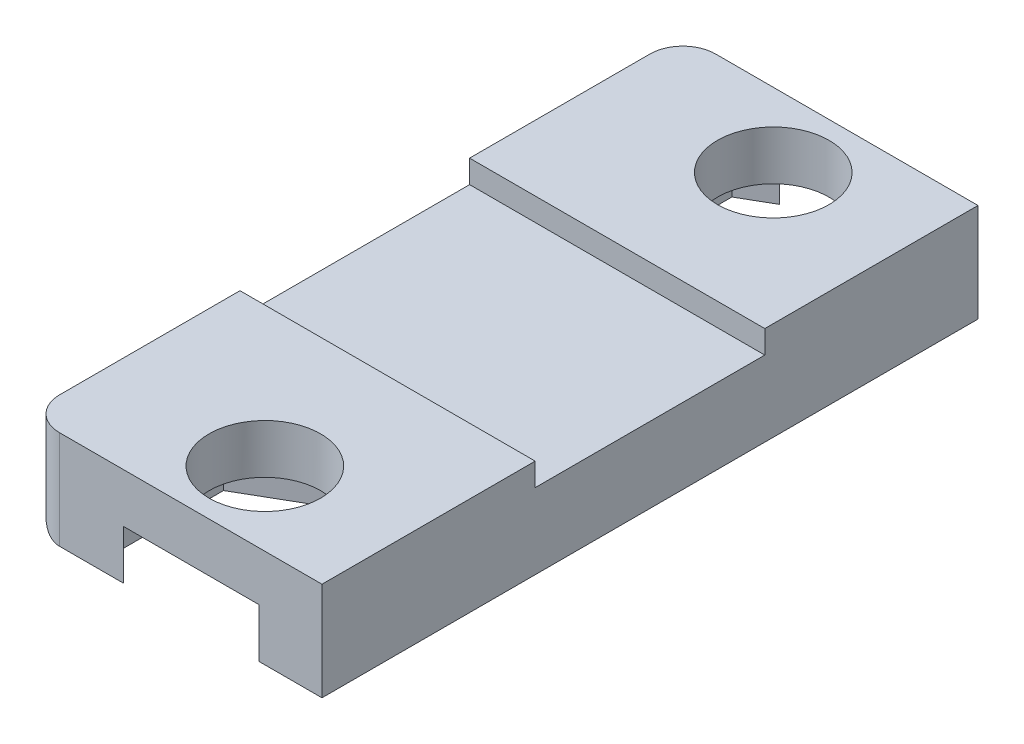
ISO-10303-21;
HEADER;
FILE_DESCRIPTION(('STEP AP214'),'2;1');
FILE_NAME('part.step','',(''),(''),'','','');
FILE_SCHEMA(('AUTOMOTIVE_DESIGN { 1 0 10303 214 1 1 1 1 }'));
ENDSEC;
DATA;
#1=APPLICATION_CONTEXT('core data for automotive mechanical design processes');
#2=APPLICATION_PROTOCOL_DEFINITION('international standard','automotive_design',2000,#1);
#3=PRODUCT_CONTEXT('',#1,'mechanical');
#4=PRODUCT('Part','Part','',(#3));
#5=PRODUCT_RELATED_PRODUCT_CATEGORY('part','',(#4));
#6=PRODUCT_DEFINITION_FORMATION('','',#4);
#7=PRODUCT_DEFINITION_CONTEXT('part definition',#1,'design');
#8=PRODUCT_DEFINITION('design','',#6,#7);
#9=PRODUCT_DEFINITION_SHAPE('','',#8);
#10=(LENGTH_UNIT() NAMED_UNIT(*) SI_UNIT(.MILLI.,.METRE.));
#11=(NAMED_UNIT(*) PLANE_ANGLE_UNIT() SI_UNIT($,.RADIAN.));
#12=(NAMED_UNIT(*) SI_UNIT($,.STERADIAN.) SOLID_ANGLE_UNIT());
#13=UNCERTAINTY_MEASURE_WITH_UNIT(LENGTH_MEASURE(1.E-05),#10,'distance_accuracy_value','');
#14=(GEOMETRIC_REPRESENTATION_CONTEXT(3) GLOBAL_UNCERTAINTY_ASSIGNED_CONTEXT((#13)) GLOBAL_UNIT_ASSIGNED_CONTEXT((#10,
#11,#12)) REPRESENTATION_CONTEXT('',''));
#15=CARTESIAN_POINT('',(0.,0.,0.));
#16=DIRECTION('',(0.,0.,1.));
#17=DIRECTION('',(1.,0.,0.));
#18=AXIS2_PLACEMENT_3D('',#15,#16,#17);
#19=CARTESIAN_POINT('',(169.955426616135,-1.,15.5));
#20=DIRECTION('',(0.,0.,1.));
#21=DIRECTION('',(1.,0.,0.));
#22=AXIS2_PLACEMENT_3D('',#19,#20,#21);
#23=PLANE('',#22);
#24=DIRECTION('',(1.,0.,0.));
#25=VECTOR('',#24,1.);
#26=CARTESIAN_POINT('',(169.954426616135,-0.7,15.5));
#27=LINE('',#26,#25);
#28=CARTESIAN_POINT('',(160.954426616135,-0.7,15.5));
#29=VERTEX_POINT('',#28);
#30=CARTESIAN_POINT('',(169.954426616135,-0.7,15.5));
#31=VERTEX_POINT('',#30);
#32=EDGE_CURVE('E56',#29,#31,#27,.T.);
#33=ORIENTED_EDGE('',*,*,#32,.F.);
#34=DIRECTION('',(0.,1.,0.));
#35=VECTOR('',#34,1.);
#36=CARTESIAN_POINT('',(160.954426616135,-1.,15.5));
#37=LINE('',#36,#35);
#38=CARTESIAN_POINT('',(160.954426616135,0.,15.5));
#39=VERTEX_POINT('',#38);
#40=EDGE_CURVE('E206',#29,#39,#37,.T.);
#41=ORIENTED_EDGE('',*,*,#40,.T.);
#42=DIRECTION('',(-1.,0.,0.));
#43=VECTOR('',#42,1.);
#44=CARTESIAN_POINT('',(169.955426616135,0.,15.5));
#45=LINE('',#44,#43);
#46=CARTESIAN_POINT('',(169.954426616135,0.,15.5));
#47=VERTEX_POINT('',#46);
#48=EDGE_CURVE('E205',#47,#39,#45,.T.);
#49=ORIENTED_EDGE('',*,*,#48,.F.);
#50=DIRECTION('',(0.,1.,0.));
#51=VECTOR('',#50,1.);
#52=CARTESIAN_POINT('',(169.954426616135,-1.,15.5));
#53=LINE('',#52,#51);
#54=EDGE_CURVE('E52',#31,#47,#53,.T.);
#55=ORIENTED_EDGE('',*,*,#54,.F.);
#56=EDGE_LOOP('',(#33,#41,#49,#55));
#57=FACE_BOUND('',#56,.T.);
#58=ADVANCED_FACE('F35',(#57),#23,.F.);
#59=CARTESIAN_POINT('',(169.955426616135,-1.,8.5));
#60=DIRECTION('',(0.,0.,-1.));
#61=DIRECTION('',(-1.,0.,0.));
#62=AXIS2_PLACEMENT_3D('',#59,#60,#61);
#63=PLANE('',#62);
#64=DIRECTION('',(-1.,0.,0.));
#65=VECTOR('',#64,1.);
#66=CARTESIAN_POINT('',(169.954426616135,-0.7,8.5));
#67=LINE('',#66,#65);
#68=CARTESIAN_POINT('',(169.954426616135,-0.7,8.5));
#69=VERTEX_POINT('',#68);
#70=CARTESIAN_POINT('',(160.954426616135,-0.7,8.5));
#71=VERTEX_POINT('',#70);
#72=EDGE_CURVE('E198',#69,#71,#67,.T.);
#73=ORIENTED_EDGE('',*,*,#72,.F.);
#74=DIRECTION('',(0.,-1.,0.));
#75=VECTOR('',#74,1.);
#76=CARTESIAN_POINT('',(169.954426616135,-1.,8.5));
#77=LINE('',#76,#75);
#78=CARTESIAN_POINT('',(169.954426616135,0.,8.5));
#79=VERTEX_POINT('',#78);
#80=EDGE_CURVE('E223',#79,#69,#77,.T.);
#81=ORIENTED_EDGE('',*,*,#80,.F.);
#82=DIRECTION('',(-1.,0.,0.));
#83=VECTOR('',#82,1.);
#84=CARTESIAN_POINT('',(169.955426616135,0.,8.5));
#85=LINE('',#84,#83);
#86=CARTESIAN_POINT('',(160.954426616135,0.,8.5));
#87=VERTEX_POINT('',#86);
#88=EDGE_CURVE('E201',#79,#87,#85,.T.);
#89=ORIENTED_EDGE('',*,*,#88,.T.);
#90=DIRECTION('',(0.,-1.,0.));
#91=VECTOR('',#90,1.);
#92=CARTESIAN_POINT('',(160.954426616135,-1.,8.5));
#93=LINE('',#92,#91);
#94=EDGE_CURVE('E195',#87,#71,#93,.T.);
#95=ORIENTED_EDGE('',*,*,#94,.T.);
#96=EDGE_LOOP('',(#73,#81,#89,#95));
#97=FACE_BOUND('',#96,.T.);
#98=ADVANCED_FACE('F197',(#97),#63,.F.);
#99=CARTESIAN_POINT('',(0.,0.,0.));
#100=DIRECTION('',(0.,1.,0.));
#101=DIRECTION('',(0.,0.,1.));
#102=AXIS2_PLACEMENT_3D('',#99,#100,#101);
#103=PLANE('',#102);
#104=DIRECTION('',(0.,0.,1.));
#105=VECTOR('',#104,1.);
#106=CARTESIAN_POINT('',(160.954426616135,0.,2.));
#107=LINE('',#106,#105);
#108=CARTESIAN_POINT('',(160.954426616135,0.,21.));
#109=VERTEX_POINT('',#108);
#110=EDGE_CURVE('E340',#39,#109,#107,.T.);
#111=ORIENTED_EDGE('',*,*,#110,.T.);
#112=CARTESIAN_POINT('',(161.954426616135,0.,21.));
#113=DIRECTION('',(0.,1.,0.));
#114=DIRECTION('',(0.,0.,1.));
#115=AXIS2_PLACEMENT_3D('',#112,#113,#114);
#116=CIRCLE('',#115,1.);
#117=CARTESIAN_POINT('',(161.954426616135,0.,22.));
#118=VERTEX_POINT('',#117);
#119=EDGE_CURVE('E44',#109,#118,#116,.T.);
#120=ORIENTED_EDGE('',*,*,#119,.T.);
#121=DIRECTION('',(1.,0.,0.));
#122=VECTOR('',#121,1.);
#123=CARTESIAN_POINT('',(160.954426616135,0.,22.));
#124=LINE('',#123,#122);
#125=CARTESIAN_POINT('',(169.954426616135,0.,22.));
#126=VERTEX_POINT('',#125);
#127=EDGE_CURVE('E354',#118,#126,#124,.T.);
#128=ORIENTED_EDGE('',*,*,#127,.T.);
#129=DIRECTION('',(0.,0.,-1.));
#130=VECTOR('',#129,1.);
#131=CARTESIAN_POINT('',(169.954426616135,0.,2.));
#132=LINE('',#131,#130);
#133=EDGE_CURVE('E357',#126,#47,#132,.T.);
#134=ORIENTED_EDGE('',*,*,#133,.T.);
#135=ORIENTED_EDGE('',*,*,#48,.T.);
#136=EDGE_LOOP('',(#111,#120,#128,#134,#135));
#137=FACE_BOUND('',#136,.T.);
#138=CARTESIAN_POINT('',(165.962302832178,0.,19.75));
#139=DIRECTION('',(0.,1.,0.));
#140=DIRECTION('',(0.,0.,1.));
#141=AXIS2_PLACEMENT_3D('',#138,#139,#140);
#142=CIRCLE('',#141,1.70000000000001);
#143=CARTESIAN_POINT('',(165.962302832178,0.,21.45));
#144=VERTEX_POINT('',#143);
#145=EDGE_CURVE('E334',#144,#144,#142,.T.);
#146=ORIENTED_EDGE('',*,*,#145,.F.);
#147=EDGE_LOOP('',(#146));
#148=FACE_BOUND('',#147,.T.);
#149=ADVANCED_FACE('F484',(#137,#148),#103,.T.);
#150=CARTESIAN_POINT('',(165.962302832178,-3.,19.75));
#151=DIRECTION('',(0.,1.,0.));
#152=DIRECTION('',(0.,0.,1.));
#153=AXIS2_PLACEMENT_3D('',#150,#151,#152);
#154=CYLINDRICAL_SURFACE('',#153,1.70000000000001);
#155=ORIENTED_EDGE('',*,*,#145,.T.);
#156=EDGE_LOOP('',(#155));
#157=FACE_BOUND('',#156,.T.);
#158=CARTESIAN_POINT('',(165.962302832178,-1.5,19.75));
#159=DIRECTION('',(0.,-1.,0.));
#160=DIRECTION('',(0.,0.,-1.));
#161=AXIS2_PLACEMENT_3D('',#158,#159,#160);
#162=CIRCLE('',#161,1.70000000000001);
#163=CARTESIAN_POINT('',(165.962302832178,-1.5,18.05));
#164=VERTEX_POINT('',#163);
#165=EDGE_CURVE('E316',#164,#164,#162,.F.);
#166=ORIENTED_EDGE('',*,*,#165,.F.);
#167=EDGE_LOOP('',(#166));
#168=FACE_BOUND('',#167,.T.);
#169=ADVANCED_FACE('F521',(#157,#168),#154,.F.);
#170=CARTESIAN_POINT('',(160.954426616135,-3.,2.));
#171=DIRECTION('',(-1.,0.,0.));
#172=DIRECTION('',(0.,0.,1.));
#173=AXIS2_PLACEMENT_3D('',#170,#171,#172);
#174=PLANE('',#173);
#175=ORIENTED_EDGE('',*,*,#40,.F.);
#176=DIRECTION('',(0.,0.,1.));
#177=VECTOR('',#176,1.);
#178=CARTESIAN_POINT('',(160.954426616135,-0.7,8.5));
#179=LINE('',#178,#177);
#180=EDGE_CURVE('E212',#71,#29,#179,.T.);
#181=ORIENTED_EDGE('',*,*,#180,.F.);
#182=ORIENTED_EDGE('',*,*,#94,.F.);
#183=CARTESIAN_POINT('',(160.954426616135,0.,3.));
#184=VERTEX_POINT('',#183);
#185=EDGE_CURVE('E352',#184,#87,#107,.T.);
#186=ORIENTED_EDGE('',*,*,#185,.F.);
#187=DIRECTION('',(0.,1.,0.));
#188=VECTOR('',#187,1.);
#189=CARTESIAN_POINT('',(160.954426616135,-3.,3.));
#190=LINE('',#189,#188);
#191=CARTESIAN_POINT('',(160.954426616135,-2.,3.));
#192=VERTEX_POINT('',#191);
#193=EDGE_CURVE('E377',#184,#192,#190,.F.);
#194=ORIENTED_EDGE('',*,*,#193,.T.);
#195=DIRECTION('',(0.,0.,1.));
#196=VECTOR('',#195,1.);
#197=CARTESIAN_POINT('',(160.954426616135,-2.,22.));
#198=LINE('',#197,#196);
#199=CARTESIAN_POINT('',(160.954426616135,-2.,21.));
#200=VERTEX_POINT('',#199);
#201=EDGE_CURVE('E374',#192,#200,#198,.T.);
#202=ORIENTED_EDGE('',*,*,#201,.T.);
#203=DIRECTION('',(0.,1.,0.));
#204=VECTOR('',#203,1.);
#205=CARTESIAN_POINT('',(160.954426616135,-3.,21.));
#206=LINE('',#205,#204);
#207=EDGE_CURVE('E366',#200,#109,#206,.T.);
#208=ORIENTED_EDGE('',*,*,#207,.T.);
#209=ORIENTED_EDGE('',*,*,#110,.F.);
#210=EDGE_LOOP('',(#175,#181,#182,#186,#194,#202,#208,#209));
#211=FACE_BOUND('',#210,.T.);
#212=ADVANCED_FACE('F216',(#211),#174,.T.);
#213=CARTESIAN_POINT('',(160.954426616135,-3.,2.));
#214=DIRECTION('',(0.,0.,-1.));
#215=DIRECTION('',(-1.,0.,0.));
#216=AXIS2_PLACEMENT_3D('',#213,#214,#215);
#217=PLANE('',#216);
#218=DIRECTION('',(-1.,0.,0.));
#219=VECTOR('',#218,1.);
#220=CARTESIAN_POINT('',(160.954426616135,-3.,2.));
#221=LINE('',#220,#219);
#222=CARTESIAN_POINT('',(163.896382905633,-3.,2.));
#223=VERTEX_POINT('',#222);
#224=CARTESIAN_POINT('',(161.954426616135,-3.,2.));
#225=VERTEX_POINT('',#224);
#226=EDGE_CURVE('E347',#223,#225,#221,.T.);
#227=ORIENTED_EDGE('',*,*,#226,.T.);
#228=DIRECTION('',(0.,1.,0.));
#229=VECTOR('',#228,1.);
#230=CARTESIAN_POINT('',(161.954426616135,-3.,2.));
#231=LINE('',#230,#229);
#232=CARTESIAN_POINT('',(161.954426616135,0.,2.));
#233=VERTEX_POINT('',#232);
#234=EDGE_CURVE('E381',#225,#233,#231,.T.);
#235=ORIENTED_EDGE('',*,*,#234,.T.);
#236=DIRECTION('',(-1.,0.,0.));
#237=VECTOR('',#236,1.);
#238=CARTESIAN_POINT('',(160.954426616135,0.,2.));
#239=LINE('',#238,#237);
#240=CARTESIAN_POINT('',(169.954426616135,0.,2.));
#241=VERTEX_POINT('',#240);
#242=EDGE_CURVE('E360',#241,#233,#239,.T.);
#243=ORIENTED_EDGE('',*,*,#242,.F.);
#244=DIRECTION('',(0.,1.,0.));
#245=VECTOR('',#244,1.);
#246=CARTESIAN_POINT('',(169.954426616135,-3.,2.));
#247=LINE('',#246,#245);
#248=CARTESIAN_POINT('',(169.954426616135,-3.,2.));
#249=VERTEX_POINT('',#248);
#250=EDGE_CURVE('E363',#249,#241,#247,.T.);
#251=ORIENTED_EDGE('',*,*,#250,.F.);
#252=CARTESIAN_POINT('',(168.028222758723,-3.,2.00000000000001));
#253=VERTEX_POINT('',#252);
#254=EDGE_CURVE('E348',#249,#253,#221,.T.);
#255=ORIENTED_EDGE('',*,*,#254,.T.);
#256=DIRECTION('',(0.,-1.,0.));
#257=VECTOR('',#256,1.);
#258=CARTESIAN_POINT('',(168.028222758723,-3.,2.));
#259=LINE('',#258,#257);
#260=CARTESIAN_POINT('',(168.028222758723,-1.5,2.));
#261=VERTEX_POINT('',#260);
#262=EDGE_CURVE('E279',#261,#253,#259,.T.);
#263=ORIENTED_EDGE('',*,*,#262,.F.);
#264=DIRECTION('',(1.,0.,0.));
#265=VECTOR('',#264,1.);
#266=CARTESIAN_POINT('',(160.954426616135,-1.5,2.));
#267=LINE('',#266,#265);
#268=CARTESIAN_POINT('',(163.896382905633,-1.5,2.));
#269=VERTEX_POINT('',#268);
#270=EDGE_CURVE('E275',#269,#261,#267,.T.);
#271=ORIENTED_EDGE('',*,*,#270,.F.);
#272=DIRECTION('',(0.,1.,0.));
#273=VECTOR('',#272,1.);
#274=CARTESIAN_POINT('',(163.896382905633,-3.,2.));
#275=LINE('',#274,#273);
#276=EDGE_CURVE('E277',#223,#269,#275,.T.);
#277=ORIENTED_EDGE('',*,*,#276,.F.);
#278=EDGE_LOOP('',(#227,#235,#243,#251,#255,#263,#271,#277));
#279=FACE_BOUND('',#278,.T.);
#280=ADVANCED_FACE('F400',(#279),#217,.T.);
#281=CARTESIAN_POINT('',(169.954426616135,-3.,2.));
#282=DIRECTION('',(1.,0.,0.));
#283=DIRECTION('',(0.,0.,-1.));
#284=AXIS2_PLACEMENT_3D('',#281,#282,#283);
#285=PLANE('',#284);
#286=DIRECTION('',(0.,0.,-1.));
#287=VECTOR('',#286,1.);
#288=CARTESIAN_POINT('',(169.954426616135,-0.7,8.5));
#289=LINE('',#288,#287);
#290=EDGE_CURVE('E214',#31,#69,#289,.T.);
#291=ORIENTED_EDGE('',*,*,#290,.F.);
#292=ORIENTED_EDGE('',*,*,#54,.T.);
#293=ORIENTED_EDGE('',*,*,#133,.F.);
#294=DIRECTION('',(0.,1.,0.));
#295=VECTOR('',#294,1.);
#296=CARTESIAN_POINT('',(169.954426616135,-3.,22.));
#297=LINE('',#296,#295);
#298=CARTESIAN_POINT('',(169.954426616135,-3.,22.));
#299=VERTEX_POINT('',#298);
#300=EDGE_CURVE('E351',#299,#126,#297,.T.);
#301=ORIENTED_EDGE('',*,*,#300,.F.);
#302=DIRECTION('',(0.,0.,-1.));
#303=VECTOR('',#302,1.);
#304=CARTESIAN_POINT('',(169.954426616135,-3.,2.));
#305=LINE('',#304,#303);
#306=EDGE_CURVE('E343',#299,#249,#305,.T.);
#307=ORIENTED_EDGE('',*,*,#306,.T.);
#308=ORIENTED_EDGE('',*,*,#250,.T.);
#309=EDGE_CURVE('E356',#79,#241,#132,.T.);
#310=ORIENTED_EDGE('',*,*,#309,.F.);
#311=ORIENTED_EDGE('',*,*,#80,.T.);
#312=EDGE_LOOP('',(#291,#292,#293,#301,#307,#308,#310,#311));
#313=FACE_BOUND('',#312,.T.);
#314=ADVANCED_FACE('F408',(#313),#285,.T.);
#315=CARTESIAN_POINT('',(160.954426616135,-3.,22.));
#316=DIRECTION('',(0.,0.,1.));
#317=DIRECTION('',(1.,0.,0.));
#318=AXIS2_PLACEMENT_3D('',#315,#316,#317);
#319=PLANE('',#318);
#320=ORIENTED_EDGE('',*,*,#127,.F.);
#321=DIRECTION('',(0.,1.,0.));
#322=VECTOR('',#321,1.);
#323=CARTESIAN_POINT('',(161.954426616135,-3.,22.));
#324=LINE('',#323,#322);
#325=CARTESIAN_POINT('',(161.954426616135,-3.,22.));
#326=VERTEX_POINT('',#325);
#327=EDGE_CURVE('E11',#118,#326,#324,.F.);
#328=ORIENTED_EDGE('',*,*,#327,.T.);
#329=DIRECTION('',(1.,0.,0.));
#330=VECTOR('',#329,1.);
#331=CARTESIAN_POINT('',(160.954426616135,-3.,22.));
#332=LINE('',#331,#330);
#333=CARTESIAN_POINT('',(163.896382905633,-3.,22.));
#334=VERTEX_POINT('',#333);
#335=EDGE_CURVE('E341',#326,#334,#332,.T.);
#336=ORIENTED_EDGE('',*,*,#335,.T.);
#337=DIRECTION('',(0.,-1.,0.));
#338=VECTOR('',#337,1.);
#339=CARTESIAN_POINT('',(163.896382905633,-3.,22.));
#340=LINE('',#339,#338);
#341=CARTESIAN_POINT('',(163.896382905633,-1.5,22.));
#342=VERTEX_POINT('',#341);
#343=EDGE_CURVE('E331',#342,#334,#340,.T.);
#344=ORIENTED_EDGE('',*,*,#343,.F.);
#345=DIRECTION('',(1.,0.,0.));
#346=VECTOR('',#345,1.);
#347=CARTESIAN_POINT('',(160.954426616135,-1.5,22.));
#348=LINE('',#347,#346);
#349=CARTESIAN_POINT('',(168.028222758723,-1.5,22.));
#350=VERTEX_POINT('',#349);
#351=EDGE_CURVE('E326',#342,#350,#348,.T.);
#352=ORIENTED_EDGE('',*,*,#351,.T.);
#353=DIRECTION('',(0.,1.,0.));
#354=VECTOR('',#353,1.);
#355=CARTESIAN_POINT('',(168.028222758723,-3.,22.));
#356=LINE('',#355,#354);
#357=CARTESIAN_POINT('',(168.028222758723,-3.,22.));
#358=VERTEX_POINT('',#357);
#359=EDGE_CURVE('E329',#358,#350,#356,.T.);
#360=ORIENTED_EDGE('',*,*,#359,.F.);
#361=EDGE_CURVE('E344',#358,#299,#332,.T.);
#362=ORIENTED_EDGE('',*,*,#361,.T.);
#363=ORIENTED_EDGE('',*,*,#300,.T.);
#364=EDGE_LOOP('',(#320,#328,#336,#344,#352,#360,#362,#363));
#365=FACE_BOUND('',#364,.T.);
#366=ADVANCED_FACE('F441',(#365),#319,.T.);
#367=CARTESIAN_POINT('',(0.,-3.,0.));
#368=DIRECTION('',(0.,1.,0.));
#369=DIRECTION('',(0.,0.,1.));
#370=AXIS2_PLACEMENT_3D('',#367,#368,#369);
#371=PLANE('',#370);
#372=ORIENTED_EDGE('',*,*,#335,.F.);
#373=DIRECTION('',(0.,0.,1.));
#374=VECTOR('',#373,1.);
#375=CARTESIAN_POINT('',(161.954426616135,-3.,2.));
#376=LINE('',#375,#374);
#377=EDGE_CURVE('E379',#326,#225,#376,.F.);
#378=ORIENTED_EDGE('',*,*,#377,.T.);
#379=ORIENTED_EDGE('',*,*,#226,.F.);
#380=DIRECTION('',(0.86602540378444,0.,-0.499999999999998));
#381=VECTOR('',#380,1.);
#382=CARTESIAN_POINT('',(165.962302832178,-3.,0.80724057428494));
#383=LINE('',#382,#381);
#384=CARTESIAN_POINT('',(162.98078571039,-3.,2.52862028714248));
#385=VERTEX_POINT('',#384);
#386=EDGE_CURVE('E257',#385,#223,#383,.T.);
#387=ORIENTED_EDGE('',*,*,#386,.F.);
#388=DIRECTION('',(0.,0.,-1.));
#389=VECTOR('',#388,1.);
#390=CARTESIAN_POINT('',(162.98078571039,-3.,2.52862028714248));
#391=LINE('',#390,#389);
#392=CARTESIAN_POINT('',(162.98078571039,-3.,5.97137971285751));
#393=VERTEX_POINT('',#392);
#394=EDGE_CURVE('E254',#393,#385,#391,.T.);
#395=ORIENTED_EDGE('',*,*,#394,.F.);
#396=DIRECTION('',(-0.866025403784439,0.,-0.5));
#397=VECTOR('',#396,1.);
#398=CARTESIAN_POINT('',(162.98078571039,-3.,5.97137971285751));
#399=LINE('',#398,#397);
#400=CARTESIAN_POINT('',(165.962302832178,-3.,7.69275942571507));
#401=VERTEX_POINT('',#400);
#402=EDGE_CURVE('E251',#401,#393,#399,.T.);
#403=ORIENTED_EDGE('',*,*,#402,.F.);
#404=DIRECTION('',(-0.866025403784439,0.,0.5));
#405=VECTOR('',#404,1.);
#406=CARTESIAN_POINT('',(165.962302832178,-3.,7.69275942571506));
#407=LINE('',#406,#405);
#408=CARTESIAN_POINT('',(168.943819953965,-3.,5.97137971285753));
#409=VERTEX_POINT('',#408);
#410=EDGE_CURVE('E228',#409,#401,#407,.T.);
#411=ORIENTED_EDGE('',*,*,#410,.F.);
#412=DIRECTION('',(0.,0.,1.));
#413=VECTOR('',#412,1.);
#414=CARTESIAN_POINT('',(168.943819953965,-3.,5.97137971285753));
#415=LINE('',#414,#413);
#416=CARTESIAN_POINT('',(168.943819953965,-3.,2.52862028714248));
#417=VERTEX_POINT('',#416);
#418=EDGE_CURVE('E235',#417,#409,#415,.T.);
#419=ORIENTED_EDGE('',*,*,#418,.F.);
#420=DIRECTION('',(0.866025403784438,0.,0.500000000000001));
#421=VECTOR('',#420,1.);
#422=CARTESIAN_POINT('',(168.943819953965,-3.,2.52862028714248));
#423=LINE('',#422,#421);
#424=EDGE_CURVE('E259',#253,#417,#423,.T.);
#425=ORIENTED_EDGE('',*,*,#424,.F.);
#426=ORIENTED_EDGE('',*,*,#254,.F.);
#427=ORIENTED_EDGE('',*,*,#306,.F.);
#428=ORIENTED_EDGE('',*,*,#361,.F.);
#429=DIRECTION('',(-0.866025403784438,0.,0.500000000000001));
#430=VECTOR('',#429,1.);
#431=CARTESIAN_POINT('',(168.943819953965,-3.,21.4713797128575));
#432=LINE('',#431,#430);
#433=CARTESIAN_POINT('',(168.943819953965,-3.,21.4713797128575));
#434=VERTEX_POINT('',#433);
#435=EDGE_CURVE('E302',#434,#358,#432,.T.);
#436=ORIENTED_EDGE('',*,*,#435,.F.);
#437=DIRECTION('',(0.,0.,1.));
#438=VECTOR('',#437,1.);
#439=CARTESIAN_POINT('',(168.943819953965,-3.,18.0286202871425));
#440=LINE('',#439,#438);
#441=CARTESIAN_POINT('',(168.943819953965,-3.,18.0286202871425));
#442=VERTEX_POINT('',#441);
#443=EDGE_CURVE('E281',#442,#434,#440,.T.);
#444=ORIENTED_EDGE('',*,*,#443,.F.);
#445=DIRECTION('',(0.866025403784439,0.,0.5));
#446=VECTOR('',#445,1.);
#447=CARTESIAN_POINT('',(165.962302832178,-3.,16.3072405742849));
#448=LINE('',#447,#446);
#449=CARTESIAN_POINT('',(165.962302832178,-3.,16.3072405742849));
#450=VERTEX_POINT('',#449);
#451=EDGE_CURVE('E286',#450,#442,#448,.T.);
#452=ORIENTED_EDGE('',*,*,#451,.F.);
#453=DIRECTION('',(0.866025403784439,0.,-0.5));
#454=VECTOR('',#453,1.);
#455=CARTESIAN_POINT('',(162.98078571039,-3.,18.0286202871425));
#456=LINE('',#455,#454);
#457=CARTESIAN_POINT('',(162.98078571039,-3.,18.0286202871425));
#458=VERTEX_POINT('',#457);
#459=EDGE_CURVE('E309',#458,#450,#456,.T.);
#460=ORIENTED_EDGE('',*,*,#459,.F.);
#461=DIRECTION('',(0.,0.,-1.));
#462=VECTOR('',#461,1.);
#463=CARTESIAN_POINT('',(162.98078571039,-3.,21.4713797128575));
#464=LINE('',#463,#462);
#465=CARTESIAN_POINT('',(162.98078571039,-3.,21.4713797128575));
#466=VERTEX_POINT('',#465);
#467=EDGE_CURVE('E306',#466,#458,#464,.T.);
#468=ORIENTED_EDGE('',*,*,#467,.F.);
#469=DIRECTION('',(-0.86602540378444,0.,-0.499999999999998));
#470=VECTOR('',#469,1.);
#471=CARTESIAN_POINT('',(165.962302832178,-3.,23.1927594257151));
#472=LINE('',#471,#470);
#473=EDGE_CURVE('E304',#334,#466,#472,.T.);
#474=ORIENTED_EDGE('',*,*,#473,.F.);
#475=EDGE_LOOP('',(#372,#378,#379,#387,#395,#403,#411,#419,#425,#426,#427,#428,#436,#444,#452,
#460,#468,#474));
#476=FACE_BOUND('',#475,.T.);
#477=ADVANCED_FACE('F417',(#476),#371,.F.);
#478=ORIENTED_EDGE('',*,*,#242,.T.);
#479=CARTESIAN_POINT('',(161.954426616135,0.,3.));
#480=DIRECTION('',(0.,1.,0.));
#481=DIRECTION('',(0.,0.,1.));
#482=AXIS2_PLACEMENT_3D('',#479,#480,#481);
#483=CIRCLE('',#482,1.);
#484=EDGE_CURVE('E383',#233,#184,#483,.T.);
#485=ORIENTED_EDGE('',*,*,#484,.T.);
#486=ORIENTED_EDGE('',*,*,#185,.T.);
#487=ORIENTED_EDGE('',*,*,#88,.F.);
#488=ORIENTED_EDGE('',*,*,#309,.T.);
#489=EDGE_LOOP('',(#478,#485,#486,#487,#488));
#490=FACE_BOUND('',#489,.T.);
#491=CARTESIAN_POINT('',(165.962302832178,0.,4.24999999999999));
#492=DIRECTION('',(0.,1.,0.));
#493=DIRECTION('',(0.,0.,1.));
#494=AXIS2_PLACEMENT_3D('',#491,#492,#493);
#495=CIRCLE('',#494,1.70000000000001);
#496=CARTESIAN_POINT('',(165.962302832178,0.,5.95));
#497=VERTEX_POINT('',#496);
#498=EDGE_CURVE('E337',#497,#497,#495,.T.);
#499=ORIENTED_EDGE('',*,*,#498,.F.);
#500=EDGE_LOOP('',(#499));
#501=FACE_BOUND('',#500,.T.);
#502=ADVANCED_FACE('F404',(#490,#501),#103,.T.);
#503=CARTESIAN_POINT('',(165.962302832178,-3.,4.24999999999999));
#504=DIRECTION('',(0.,1.,0.));
#505=DIRECTION('',(0.,0.,1.));
#506=AXIS2_PLACEMENT_3D('',#503,#504,#505);
#507=CYLINDRICAL_SURFACE('',#506,1.70000000000001);
#508=CARTESIAN_POINT('',(165.962302832178,-1.5,4.24999999999999));
#509=DIRECTION('',(0.,1.,0.));
#510=DIRECTION('',(0.,0.,1.));
#511=AXIS2_PLACEMENT_3D('',#508,#509,#510);
#512=CIRCLE('',#511,1.70000000000001);
#513=CARTESIAN_POINT('',(165.962302832178,-1.5,5.95));
#514=VERTEX_POINT('',#513);
#515=EDGE_CURVE('E265',#514,#514,#512,.F.);
#516=ORIENTED_EDGE('',*,*,#515,.T.);
#517=EDGE_LOOP('',(#516));
#518=FACE_BOUND('',#517,.T.);
#519=ORIENTED_EDGE('',*,*,#498,.T.);
#520=EDGE_LOOP('',(#519));
#521=FACE_BOUND('',#520,.T.);
#522=ADVANCED_FACE('F511',(#518,#521),#507,.F.);
#523=CARTESIAN_POINT('',(0.,-1.5,0.));
#524=DIRECTION('',(0.,-1.,0.));
#525=DIRECTION('',(0.,0.,-1.));
#526=AXIS2_PLACEMENT_3D('',#523,#524,#525);
#527=PLANE('',#526);
#528=DIRECTION('',(-0.86602540378444,0.,-0.499999999999998));
#529=VECTOR('',#528,1.);
#530=CARTESIAN_POINT('',(165.962302832178,-1.5,23.1927594257151));
#531=LINE('',#530,#529);
#532=CARTESIAN_POINT('',(162.98078571039,-1.5,21.4713797128575));
#533=VERTEX_POINT('',#532);
#534=EDGE_CURVE('E289',#342,#533,#531,.T.);
#535=ORIENTED_EDGE('',*,*,#534,.T.);
#536=DIRECTION('',(0.,0.,-1.));
#537=VECTOR('',#536,1.);
#538=CARTESIAN_POINT('',(162.98078571039,-1.5,21.4713797128575));
#539=LINE('',#538,#537);
#540=CARTESIAN_POINT('',(162.98078571039,-1.5,18.0286202871425));
#541=VERTEX_POINT('',#540);
#542=EDGE_CURVE('E291',#533,#541,#539,.T.);
#543=ORIENTED_EDGE('',*,*,#542,.T.);
#544=DIRECTION('',(0.866025403784439,0.,-0.5));
#545=VECTOR('',#544,1.);
#546=CARTESIAN_POINT('',(162.98078571039,-1.5,18.0286202871425));
#547=LINE('',#546,#545);
#548=CARTESIAN_POINT('',(165.962302832178,-1.5,16.3072405742849));
#549=VERTEX_POINT('',#548);
#550=EDGE_CURVE('E294',#541,#549,#547,.T.);
#551=ORIENTED_EDGE('',*,*,#550,.T.);
#552=DIRECTION('',(0.866025403784439,0.,0.5));
#553=VECTOR('',#552,1.);
#554=CARTESIAN_POINT('',(165.962302832178,-1.5,16.3072405742849));
#555=LINE('',#554,#553);
#556=CARTESIAN_POINT('',(168.943819953965,-1.5,18.0286202871425));
#557=VERTEX_POINT('',#556);
#558=EDGE_CURVE('E297',#549,#557,#555,.T.);
#559=ORIENTED_EDGE('',*,*,#558,.T.);
#560=DIRECTION('',(0.,0.,1.));
#561=VECTOR('',#560,1.);
#562=CARTESIAN_POINT('',(168.943819953965,-1.5,18.0286202871425));
#563=LINE('',#562,#561);
#564=CARTESIAN_POINT('',(168.943819953965,-1.5,21.4713797128575));
#565=VERTEX_POINT('',#564);
#566=EDGE_CURVE('E282',#557,#565,#563,.T.);
#567=ORIENTED_EDGE('',*,*,#566,.T.);
#568=DIRECTION('',(-0.866025403784438,0.,0.500000000000001));
#569=VECTOR('',#568,1.);
#570=CARTESIAN_POINT('',(168.943819953965,-1.5,21.4713797128575));
#571=LINE('',#570,#569);
#572=EDGE_CURVE('E285',#565,#350,#571,.T.);
#573=ORIENTED_EDGE('',*,*,#572,.T.);
#574=ORIENTED_EDGE('',*,*,#351,.F.);
#575=EDGE_LOOP('',(#535,#543,#551,#559,#567,#573,#574));
#576=FACE_BOUND('',#575,.T.);
#577=ORIENTED_EDGE('',*,*,#165,.T.);
#578=EDGE_LOOP('',(#577));
#579=FACE_BOUND('',#578,.T.);
#580=ADVANCED_FACE('F449',(#576,#579),#527,.T.);
#581=CARTESIAN_POINT('',(168.943819953965,-1.5,18.0286202871425));
#582=DIRECTION('',(1.,0.,0.));
#583=DIRECTION('',(0.,0.,-1.));
#584=AXIS2_PLACEMENT_3D('',#581,#582,#583);
#585=PLANE('',#584);
#586=ORIENTED_EDGE('',*,*,#443,.T.);
#587=DIRECTION('',(0.,-1.,0.));
#588=VECTOR('',#587,1.);
#589=CARTESIAN_POINT('',(168.943819953965,-1.5,21.4713797128575));
#590=LINE('',#589,#588);
#591=EDGE_CURVE('E300',#565,#434,#590,.T.);
#592=ORIENTED_EDGE('',*,*,#591,.F.);
#593=ORIENTED_EDGE('',*,*,#566,.F.);
#594=DIRECTION('',(0.,-1.,0.));
#595=VECTOR('',#594,1.);
#596=CARTESIAN_POINT('',(168.943819953965,-1.5,18.0286202871425));
#597=LINE('',#596,#595);
#598=EDGE_CURVE('E314',#557,#442,#597,.T.);
#599=ORIENTED_EDGE('',*,*,#598,.T.);
#600=EDGE_LOOP('',(#586,#592,#593,#599));
#601=FACE_BOUND('',#600,.T.);
#602=ADVANCED_FACE('F460',(#601),#585,.F.);
#603=CARTESIAN_POINT('',(165.962302832178,-1.5,16.3072405742849));
#604=DIRECTION('',(0.5,0.,-0.866025403784438));
#605=DIRECTION('',(-0.866025403784439,0.,-0.5));
#606=AXIS2_PLACEMENT_3D('',#603,#604,#605);
#607=PLANE('',#606);
#608=ORIENTED_EDGE('',*,*,#451,.T.);
#609=ORIENTED_EDGE('',*,*,#598,.F.);
#610=ORIENTED_EDGE('',*,*,#558,.F.);
#611=DIRECTION('',(0.,-1.,0.));
#612=VECTOR('',#611,1.);
#613=CARTESIAN_POINT('',(165.962302832178,-1.5,16.3072405742849));
#614=LINE('',#613,#612);
#615=EDGE_CURVE('E317',#549,#450,#614,.T.);
#616=ORIENTED_EDGE('',*,*,#615,.T.);
#617=EDGE_LOOP('',(#608,#609,#610,#616));
#618=FACE_BOUND('',#617,.T.);
#619=ADVANCED_FACE('F463',(#618),#607,.F.);
#620=CARTESIAN_POINT('',(162.98078571039,-1.5,18.0286202871425));
#621=DIRECTION('',(-0.5,0.,-0.866025403784439));
#622=DIRECTION('',(-0.866025403784439,0.,0.5));
#623=AXIS2_PLACEMENT_3D('',#620,#621,#622);
#624=PLANE('',#623);
#625=ORIENTED_EDGE('',*,*,#459,.T.);
#626=ORIENTED_EDGE('',*,*,#615,.F.);
#627=ORIENTED_EDGE('',*,*,#550,.F.);
#628=DIRECTION('',(0.,-1.,0.));
#629=VECTOR('',#628,1.);
#630=CARTESIAN_POINT('',(162.98078571039,-1.5,18.0286202871425));
#631=LINE('',#630,#629);
#632=EDGE_CURVE('E319',#541,#458,#631,.T.);
#633=ORIENTED_EDGE('',*,*,#632,.T.);
#634=EDGE_LOOP('',(#625,#626,#627,#633));
#635=FACE_BOUND('',#634,.T.);
#636=ADVANCED_FACE('F466',(#635),#624,.F.);
#637=CARTESIAN_POINT('',(162.98078571039,-1.5,21.4713797128575));
#638=DIRECTION('',(-1.,0.,0.));
#639=DIRECTION('',(0.,0.,1.));
#640=AXIS2_PLACEMENT_3D('',#637,#638,#639);
#641=PLANE('',#640);
#642=ORIENTED_EDGE('',*,*,#467,.T.);
#643=ORIENTED_EDGE('',*,*,#632,.F.);
#644=ORIENTED_EDGE('',*,*,#542,.F.);
#645=DIRECTION('',(0.,-1.,0.));
#646=VECTOR('',#645,1.);
#647=CARTESIAN_POINT('',(162.98078571039,-1.5,21.4713797128575));
#648=LINE('',#647,#646);
#649=EDGE_CURVE('E321',#533,#466,#648,.T.);
#650=ORIENTED_EDGE('',*,*,#649,.T.);
#651=EDGE_LOOP('',(#642,#643,#644,#650));
#652=FACE_BOUND('',#651,.T.);
#653=ADVANCED_FACE('F469',(#652),#641,.F.);
#654=CARTESIAN_POINT('',(165.962302832178,-1.5,23.1927594257151));
#655=DIRECTION('',(-0.499999999999998,0.,0.86602540378444));
#656=DIRECTION('',(0.86602540378444,0.,0.499999999999998));
#657=AXIS2_PLACEMENT_3D('',#654,#655,#656);
#658=PLANE('',#657);
#659=ORIENTED_EDGE('',*,*,#343,.T.);
#660=ORIENTED_EDGE('',*,*,#473,.T.);
#661=ORIENTED_EDGE('',*,*,#649,.F.);
#662=ORIENTED_EDGE('',*,*,#534,.F.);
#663=EDGE_LOOP('',(#659,#660,#661,#662));
#664=FACE_BOUND('',#663,.T.);
#665=ADVANCED_FACE('F445',(#664),#658,.F.);
#666=CARTESIAN_POINT('',(168.943819953965,-1.5,21.4713797128575));
#667=DIRECTION('',(0.500000000000001,0.,0.866025403784438));
#668=DIRECTION('',(0.866025403784438,0.,-0.500000000000001));
#669=AXIS2_PLACEMENT_3D('',#666,#667,#668);
#670=PLANE('',#669);
#671=ORIENTED_EDGE('',*,*,#359,.T.);
#672=ORIENTED_EDGE('',*,*,#572,.F.);
#673=ORIENTED_EDGE('',*,*,#591,.T.);
#674=ORIENTED_EDGE('',*,*,#435,.T.);
#675=EDGE_LOOP('',(#671,#672,#673,#674));
#676=FACE_BOUND('',#675,.T.);
#677=ADVANCED_FACE('F457',(#676),#670,.F.);
#678=CARTESIAN_POINT('',(0.,-1.5,0.));
#679=DIRECTION('',(0.,1.,0.));
#680=DIRECTION('',(0.,0.,1.));
#681=AXIS2_PLACEMENT_3D('',#678,#679,#680);
#682=PLANE('',#681);
#683=ORIENTED_EDGE('',*,*,#270,.T.);
#684=DIRECTION('',(0.866025403784438,0.,0.500000000000001));
#685=VECTOR('',#684,1.);
#686=CARTESIAN_POINT('',(168.943819953965,-1.5,2.52862028714248));
#687=LINE('',#686,#685);
#688=CARTESIAN_POINT('',(168.943819953965,-1.5,2.52862028714248));
#689=VERTEX_POINT('',#688);
#690=EDGE_CURVE('E244',#261,#689,#687,.T.);
#691=ORIENTED_EDGE('',*,*,#690,.T.);
#692=DIRECTION('',(0.,0.,1.));
#693=VECTOR('',#692,1.);
#694=CARTESIAN_POINT('',(168.943819953965,-1.5,5.97137971285753));
#695=LINE('',#694,#693);
#696=CARTESIAN_POINT('',(168.943819953965,-1.5,5.97137971285753));
#697=VERTEX_POINT('',#696);
#698=EDGE_CURVE('E246',#689,#697,#695,.T.);
#699=ORIENTED_EDGE('',*,*,#698,.T.);
#700=DIRECTION('',(-0.866025403784439,0.,0.5));
#701=VECTOR('',#700,1.);
#702=CARTESIAN_POINT('',(165.962302832178,-1.5,7.69275942571506));
#703=LINE('',#702,#701);
#704=CARTESIAN_POINT('',(165.962302832178,-1.5,7.69275942571506));
#705=VERTEX_POINT('',#704);
#706=EDGE_CURVE('E231',#697,#705,#703,.T.);
#707=ORIENTED_EDGE('',*,*,#706,.T.);
#708=DIRECTION('',(-0.866025403784439,0.,-0.5));
#709=VECTOR('',#708,1.);
#710=CARTESIAN_POINT('',(162.98078571039,-1.5,5.97137971285751));
#711=LINE('',#710,#709);
#712=CARTESIAN_POINT('',(162.98078571039,-1.5,5.97137971285751));
#713=VERTEX_POINT('',#712);
#714=EDGE_CURVE('E234',#705,#713,#711,.T.);
#715=ORIENTED_EDGE('',*,*,#714,.T.);
#716=DIRECTION('',(0.,0.,-1.));
#717=VECTOR('',#716,1.);
#718=CARTESIAN_POINT('',(162.98078571039,-1.5,2.52862028714248));
#719=LINE('',#718,#717);
#720=CARTESIAN_POINT('',(162.98078571039,-1.5,2.52862028714248));
#721=VERTEX_POINT('',#720);
#722=EDGE_CURVE('E238',#713,#721,#719,.T.);
#723=ORIENTED_EDGE('',*,*,#722,.T.);
#724=DIRECTION('',(0.86602540378444,0.,-0.499999999999998));
#725=VECTOR('',#724,1.);
#726=CARTESIAN_POINT('',(165.962302832178,-1.5,0.80724057428494));
#727=LINE('',#726,#725);
#728=EDGE_CURVE('E241',#721,#269,#727,.T.);
#729=ORIENTED_EDGE('',*,*,#728,.T.);
#730=EDGE_LOOP('',(#683,#691,#699,#707,#715,#723,#729));
#731=FACE_BOUND('',#730,.T.);
#732=ORIENTED_EDGE('',*,*,#515,.F.);
#733=EDGE_LOOP('',(#732));
#734=FACE_BOUND('',#733,.T.);
#735=ADVANCED_FACE('F430',(#731,#734),#682,.F.);
#736=CARTESIAN_POINT('',(165.962302832178,-1.5,7.69275942571506));
#737=DIRECTION('',(0.5,0.,0.866025403784438));
#738=DIRECTION('',(0.866025403784439,0.,-0.5));
#739=AXIS2_PLACEMENT_3D('',#736,#737,#738);
#740=PLANE('',#739);
#741=ORIENTED_EDGE('',*,*,#410,.T.);
#742=DIRECTION('',(0.,-1.,0.));
#743=VECTOR('',#742,1.);
#744=CARTESIAN_POINT('',(165.962302832178,-1.5,7.69275942571506));
#745=LINE('',#744,#743);
#746=EDGE_CURVE('E249',#705,#401,#745,.T.);
#747=ORIENTED_EDGE('',*,*,#746,.F.);
#748=ORIENTED_EDGE('',*,*,#706,.F.);
#749=DIRECTION('',(0.,-1.,0.));
#750=VECTOR('',#749,1.);
#751=CARTESIAN_POINT('',(168.943819953965,-1.5,5.97137971285753));
#752=LINE('',#751,#750);
#753=EDGE_CURVE('E263',#697,#409,#752,.T.);
#754=ORIENTED_EDGE('',*,*,#753,.T.);
#755=EDGE_LOOP('',(#741,#747,#748,#754));
#756=FACE_BOUND('',#755,.T.);
#757=ADVANCED_FACE('F490',(#756),#740,.F.);
#758=CARTESIAN_POINT('',(168.943819953965,-1.5,5.97137971285753));
#759=DIRECTION('',(1.,0.,0.));
#760=DIRECTION('',(0.,0.,-1.));
#761=AXIS2_PLACEMENT_3D('',#758,#759,#760);
#762=PLANE('',#761);
#763=ORIENTED_EDGE('',*,*,#418,.T.);
#764=ORIENTED_EDGE('',*,*,#753,.F.);
#765=ORIENTED_EDGE('',*,*,#698,.F.);
#766=DIRECTION('',(0.,-1.,0.));
#767=VECTOR('',#766,1.);
#768=CARTESIAN_POINT('',(168.943819953965,-1.5,2.52862028714248));
#769=LINE('',#768,#767);
#770=EDGE_CURVE('E266',#689,#417,#769,.T.);
#771=ORIENTED_EDGE('',*,*,#770,.T.);
#772=EDGE_LOOP('',(#763,#764,#765,#771));
#773=FACE_BOUND('',#772,.T.);
#774=ADVANCED_FACE('F427',(#773),#762,.F.);
#775=CARTESIAN_POINT('',(168.943819953965,-1.5,2.52862028714248));
#776=DIRECTION('',(0.500000000000001,0.,-0.866025403784438));
#777=DIRECTION('',(-0.866025403784438,0.,-0.500000000000001));
#778=AXIS2_PLACEMENT_3D('',#775,#776,#777);
#779=PLANE('',#778);
#780=ORIENTED_EDGE('',*,*,#262,.T.);
#781=ORIENTED_EDGE('',*,*,#424,.T.);
#782=ORIENTED_EDGE('',*,*,#770,.F.);
#783=ORIENTED_EDGE('',*,*,#690,.F.);
#784=EDGE_LOOP('',(#780,#781,#782,#783));
#785=FACE_BOUND('',#784,.T.);
#786=ADVANCED_FACE('F423',(#785),#779,.F.);
#787=CARTESIAN_POINT('',(165.962302832178,-1.5,0.80724057428494));
#788=DIRECTION('',(-0.499999999999998,0.,-0.86602540378444));
#789=DIRECTION('',(-0.86602540378444,0.,0.499999999999998));
#790=AXIS2_PLACEMENT_3D('',#787,#788,#789);
#791=PLANE('',#790);
#792=ORIENTED_EDGE('',*,*,#276,.T.);
#793=ORIENTED_EDGE('',*,*,#728,.F.);
#794=DIRECTION('',(0.,-1.,0.));
#795=VECTOR('',#794,1.);
#796=CARTESIAN_POINT('',(162.98078571039,-1.5,2.52862028714248));
#797=LINE('',#796,#795);
#798=EDGE_CURVE('E269',#721,#385,#797,.T.);
#799=ORIENTED_EDGE('',*,*,#798,.T.);
#800=ORIENTED_EDGE('',*,*,#386,.T.);
#801=EDGE_LOOP('',(#792,#793,#799,#800));
#802=FACE_BOUND('',#801,.T.);
#803=ADVANCED_FACE('F495',(#802),#791,.F.);
#804=CARTESIAN_POINT('',(162.98078571039,-1.5,2.52862028714248));
#805=DIRECTION('',(-1.,0.,0.));
#806=DIRECTION('',(0.,0.,1.));
#807=AXIS2_PLACEMENT_3D('',#804,#805,#806);
#808=PLANE('',#807);
#809=ORIENTED_EDGE('',*,*,#394,.T.);
#810=ORIENTED_EDGE('',*,*,#798,.F.);
#811=ORIENTED_EDGE('',*,*,#722,.F.);
#812=DIRECTION('',(0.,-1.,0.));
#813=VECTOR('',#812,1.);
#814=CARTESIAN_POINT('',(162.98078571039,-1.5,5.97137971285751));
#815=LINE('',#814,#813);
#816=EDGE_CURVE('E271',#713,#393,#815,.T.);
#817=ORIENTED_EDGE('',*,*,#816,.T.);
#818=EDGE_LOOP('',(#809,#810,#811,#817));
#819=FACE_BOUND('',#818,.T.);
#820=ADVANCED_FACE('F498',(#819),#808,.F.);
#821=CARTESIAN_POINT('',(162.98078571039,-1.5,5.97137971285751));
#822=DIRECTION('',(-0.5,0.,0.866025403784439));
#823=DIRECTION('',(0.866025403784439,0.,0.5));
#824=AXIS2_PLACEMENT_3D('',#821,#822,#823);
#825=PLANE('',#824);
#826=ORIENTED_EDGE('',*,*,#402,.T.);
#827=ORIENTED_EDGE('',*,*,#816,.F.);
#828=ORIENTED_EDGE('',*,*,#714,.F.);
#829=ORIENTED_EDGE('',*,*,#746,.T.);
#830=EDGE_LOOP('',(#826,#827,#828,#829));
#831=FACE_BOUND('',#830,.T.);
#832=ADVANCED_FACE('F501',(#831),#825,.F.);
#833=CARTESIAN_POINT('',(161.954426616135,-3.,3.));
#834=DIRECTION('',(0.,1.,0.));
#835=DIRECTION('',(0.,0.,1.));
#836=AXIS2_PLACEMENT_3D('',#833,#834,#835);
#837=CYLINDRICAL_SURFACE('',#836,1.);
#838=ORIENTED_EDGE('',*,*,#484,.F.);
#839=ORIENTED_EDGE('',*,*,#234,.F.);
#840=CARTESIAN_POINT('',(161.954426616135,-2.,3.));
#841=DIRECTION('',(0.,0.707106781186547,-0.707106781186547));
#842=DIRECTION('',(0.,0.707106781186547,0.707106781186547));
#843=AXIS2_PLACEMENT_3D('',#840,#841,#842);
#844=ELLIPSE('',#843,1.41421356237309,1.);
#845=EDGE_CURVE('E39',#192,#225,#844,.F.);
#846=ORIENTED_EDGE('',*,*,#845,.F.);
#847=ORIENTED_EDGE('',*,*,#193,.F.);
#848=EDGE_LOOP('',(#838,#839,#846,#847));
#849=FACE_BOUND('',#848,.T.);
#850=ADVANCED_FACE('F37',(#849),#837,.T.);
#851=CARTESIAN_POINT('',(161.954426616135,-3.,21.));
#852=DIRECTION('',(0.,1.,0.));
#853=DIRECTION('',(0.,0.,1.));
#854=AXIS2_PLACEMENT_3D('',#851,#852,#853);
#855=CYLINDRICAL_SURFACE('',#854,1.);
#856=ORIENTED_EDGE('',*,*,#119,.F.);
#857=ORIENTED_EDGE('',*,*,#207,.F.);
#858=CARTESIAN_POINT('',(161.954426616135,-2.,21.));
#859=DIRECTION('',(0.,0.707106781186547,0.707106781186547));
#860=DIRECTION('',(0.,0.707106781186547,-0.707106781186547));
#861=AXIS2_PLACEMENT_3D('',#858,#859,#860);
#862=ELLIPSE('',#861,1.41421356237309,1.);
#863=EDGE_CURVE('E219',#326,#200,#862,.F.);
#864=ORIENTED_EDGE('',*,*,#863,.F.);
#865=ORIENTED_EDGE('',*,*,#327,.F.);
#866=EDGE_LOOP('',(#856,#857,#864,#865));
#867=FACE_BOUND('',#866,.T.);
#868=ADVANCED_FACE('F541',(#867),#855,.T.);
#869=CARTESIAN_POINT('',(161.954426616135,-2.,2.));
#870=DIRECTION('',(0.,0.,-1.));
#871=DIRECTION('',(-1.,0.,0.));
#872=AXIS2_PLACEMENT_3D('',#869,#870,#871);
#873=CYLINDRICAL_SURFACE('',#872,1.);
#874=ORIENTED_EDGE('',*,*,#845,.T.);
#875=ORIENTED_EDGE('',*,*,#377,.F.);
#876=ORIENTED_EDGE('',*,*,#863,.T.);
#877=ORIENTED_EDGE('',*,*,#201,.F.);
#878=EDGE_LOOP('',(#874,#875,#876,#877));
#879=FACE_BOUND('',#878,.T.);
#880=ADVANCED_FACE('F392',(#879),#873,.T.);
#881=CARTESIAN_POINT('',(0.,-0.7,0.));
#882=DIRECTION('',(0.,-1.,0.));
#883=DIRECTION('',(0.,0.,-1.));
#884=AXIS2_PLACEMENT_3D('',#881,#882,#883);
#885=PLANE('',#884);
#886=ORIENTED_EDGE('',*,*,#290,.T.);
#887=ORIENTED_EDGE('',*,*,#72,.T.);
#888=ORIENTED_EDGE('',*,*,#180,.T.);
#889=ORIENTED_EDGE('',*,*,#32,.T.);
#890=EDGE_LOOP('',(#886,#887,#888,#889));
#891=FACE_BOUND('',#890,.T.);
#892=ADVANCED_FACE('F211',(#891),#885,.F.);
#893=CLOSED_SHELL('',(#58,#98,#149,#169,#212,#280,#314,#366,#477,#502,#522,#580,#602,#619,#636,
#653,#665,#677,#735,#757,#774,#786,#803,#820,#832,#850,#868,#880,#892));
#894=MANIFOLD_SOLID_BREP('B2',#893);
#895=ADVANCED_BREP_SHAPE_REPRESENTATION('',(#18,#894),#14);
#896=SHAPE_DEFINITION_REPRESENTATION(#9,#895);
ENDSEC;
END-ISO-10303-21;
